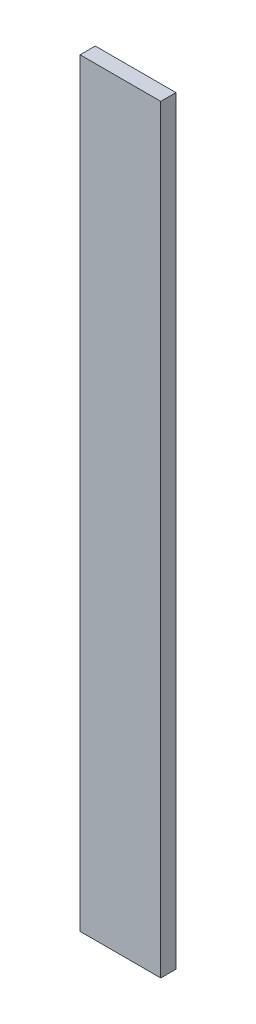
ISO-10303-21;
HEADER;
FILE_DESCRIPTION(('STEP AP214'),'2;1');
FILE_NAME('part.step','',(''),(''),'','','');
FILE_SCHEMA(('AUTOMOTIVE_DESIGN { 1 0 10303 214 1 1 1 1 }'));
ENDSEC;
DATA;
#1=APPLICATION_CONTEXT('core data for automotive mechanical design processes');
#2=APPLICATION_PROTOCOL_DEFINITION('international standard','automotive_design',2000,#1);
#3=PRODUCT_CONTEXT('',#1,'mechanical');
#4=PRODUCT('Part','Part','',(#3));
#5=PRODUCT_RELATED_PRODUCT_CATEGORY('part','',(#4));
#6=PRODUCT_DEFINITION_FORMATION('','',#4);
#7=PRODUCT_DEFINITION_CONTEXT('part definition',#1,'design');
#8=PRODUCT_DEFINITION('design','',#6,#7);
#9=PRODUCT_DEFINITION_SHAPE('','',#8);
#10=(LENGTH_UNIT() NAMED_UNIT(*) SI_UNIT(.MILLI.,.METRE.));
#11=(NAMED_UNIT(*) PLANE_ANGLE_UNIT() SI_UNIT($,.RADIAN.));
#12=(NAMED_UNIT(*) SI_UNIT($,.STERADIAN.) SOLID_ANGLE_UNIT());
#13=UNCERTAINTY_MEASURE_WITH_UNIT(LENGTH_MEASURE(1.E-05),#10,'distance_accuracy_value','');
#14=(GEOMETRIC_REPRESENTATION_CONTEXT(3) GLOBAL_UNCERTAINTY_ASSIGNED_CONTEXT((#13)) GLOBAL_UNIT_ASSIGNED_CONTEXT((#10,
#11,#12)) REPRESENTATION_CONTEXT('',''));
#15=CARTESIAN_POINT('',(0.,0.,0.));
#16=DIRECTION('',(0.,0.,1.));
#17=DIRECTION('',(1.,0.,0.));
#18=AXIS2_PLACEMENT_3D('',#15,#16,#17);
#19=CARTESIAN_POINT('',(165.444122233613,142.200586634191,5.9));
#20=DIRECTION('',(0.,0.,1.));
#21=DIRECTION('',(1.,0.,0.));
#22=AXIS2_PLACEMENT_3D('',#19,#20,#21);
#23=PLANE('',#22);
#24=DIRECTION('',(1.,0.,0.));
#25=VECTOR('',#24,1.);
#26=CARTESIAN_POINT('',(165.444122233613,147.200586634191,5.9));
#27=LINE('',#26,#25);
#28=CARTESIAN_POINT('',(165.975372233613,147.200586634191,5.9));
#29=VERTEX_POINT('',#28);
#30=CARTESIAN_POINT('',(165.444122233613,147.200586634191,5.9));
#31=VERTEX_POINT('',#30);
#32=EDGE_CURVE('E20',#29,#31,#27,.F.);
#33=ORIENTED_EDGE('',*,*,#32,.F.);
#34=DIRECTION('',(0.,1.,0.));
#35=VECTOR('',#34,1.);
#36=CARTESIAN_POINT('',(165.975372233613,142.200586634191,5.9));
#37=LINE('',#36,#35);
#38=CARTESIAN_POINT('',(165.975372233613,142.200586634191,5.9));
#39=VERTEX_POINT('',#38);
#40=EDGE_CURVE('E69',#29,#39,#37,.F.);
#41=ORIENTED_EDGE('',*,*,#40,.T.);
#42=DIRECTION('',(1.,0.,0.));
#43=VECTOR('',#42,1.);
#44=CARTESIAN_POINT('',(165.444122233613,142.200586634191,5.9));
#45=LINE('',#44,#43);
#46=CARTESIAN_POINT('',(165.444122233613,142.200586634191,5.9));
#47=VERTEX_POINT('',#46);
#48=EDGE_CURVE('E56',#39,#47,#45,.F.);
#49=ORIENTED_EDGE('',*,*,#48,.T.);
#50=DIRECTION('',(0.,1.,0.));
#51=VECTOR('',#50,1.);
#52=CARTESIAN_POINT('',(165.444122233613,147.200586634191,5.9));
#53=LINE('',#52,#51);
#54=EDGE_CURVE('E62',#47,#31,#53,.T.);
#55=ORIENTED_EDGE('',*,*,#54,.T.);
#56=EDGE_LOOP('',(#33,#41,#49,#55));
#57=FACE_BOUND('',#56,.T.);
#58=ADVANCED_FACE('F17',(#57),#23,.F.);
#59=CARTESIAN_POINT('',(165.444122233613,147.200586634191,6.));
#60=DIRECTION('',(1.,0.,0.));
#61=DIRECTION('',(0.,0.,-1.));
#62=AXIS2_PLACEMENT_3D('',#59,#60,#61);
#63=PLANE('',#62);
#64=DIRECTION('',(0.,0.,1.));
#65=VECTOR('',#64,1.);
#66=CARTESIAN_POINT('',(165.444122233613,142.200586634191,6.));
#67=LINE('',#66,#65);
#68=CARTESIAN_POINT('',(165.444122233613,142.200586634191,6.));
#69=VERTEX_POINT('',#68);
#70=EDGE_CURVE('E64',#47,#69,#67,.T.);
#71=ORIENTED_EDGE('',*,*,#70,.T.);
#72=DIRECTION('',(0.,1.,0.));
#73=VECTOR('',#72,1.);
#74=CARTESIAN_POINT('',(165.444122233613,142.200586634191,6.));
#75=LINE('',#74,#73);
#76=CARTESIAN_POINT('',(165.444122233613,147.200586634191,6.));
#77=VERTEX_POINT('',#76);
#78=EDGE_CURVE('E83',#77,#69,#75,.F.);
#79=ORIENTED_EDGE('',*,*,#78,.F.);
#80=DIRECTION('',(0.,0.,-1.));
#81=VECTOR('',#80,1.);
#82=CARTESIAN_POINT('',(165.444122233613,147.200586634191,6.));
#83=LINE('',#82,#81);
#84=EDGE_CURVE('E67',#77,#31,#83,.T.);
#85=ORIENTED_EDGE('',*,*,#84,.T.);
#86=ORIENTED_EDGE('',*,*,#54,.F.);
#87=EDGE_LOOP('',(#71,#79,#85,#86));
#88=FACE_BOUND('',#87,.T.);
#89=ADVANCED_FACE('F63',(#88),#63,.F.);
#90=CARTESIAN_POINT('',(165.444122233613,142.200586634191,6.));
#91=DIRECTION('',(0.,1.,0.));
#92=DIRECTION('',(0.,0.,1.));
#93=AXIS2_PLACEMENT_3D('',#90,#91,#92);
#94=PLANE('',#93);
#95=DIRECTION('',(0.,0.,1.));
#96=VECTOR('',#95,1.);
#97=CARTESIAN_POINT('',(165.975372233613,142.200586634191,6.));
#98=LINE('',#97,#96);
#99=CARTESIAN_POINT('',(165.975372233613,142.200586634191,6.));
#100=VERTEX_POINT('',#99);
#101=EDGE_CURVE('E71',#39,#100,#98,.T.);
#102=ORIENTED_EDGE('',*,*,#101,.T.);
#103=DIRECTION('',(1.,0.,0.));
#104=VECTOR('',#103,1.);
#105=CARTESIAN_POINT('',(165.444122233613,142.200586634191,6.));
#106=LINE('',#105,#104);
#107=EDGE_CURVE('E75',#69,#100,#106,.T.);
#108=ORIENTED_EDGE('',*,*,#107,.F.);
#109=ORIENTED_EDGE('',*,*,#70,.F.);
#110=ORIENTED_EDGE('',*,*,#48,.F.);
#111=EDGE_LOOP('',(#102,#108,#109,#110));
#112=FACE_BOUND('',#111,.T.);
#113=ADVANCED_FACE('F73',(#112),#94,.F.);
#114=CARTESIAN_POINT('',(165.975372233613,142.200586634191,6.));
#115=DIRECTION('',(-1.,0.,0.));
#116=DIRECTION('',(0.,0.,1.));
#117=AXIS2_PLACEMENT_3D('',#114,#115,#116);
#118=PLANE('',#117);
#119=DIRECTION('',(0.,0.,-1.));
#120=VECTOR('',#119,1.);
#121=CARTESIAN_POINT('',(165.975372233613,147.200586634191,6.));
#122=LINE('',#121,#120);
#123=CARTESIAN_POINT('',(165.975372233613,147.200586634191,6.));
#124=VERTEX_POINT('',#123);
#125=EDGE_CURVE('E35',#29,#124,#122,.F.);
#126=ORIENTED_EDGE('',*,*,#125,.T.);
#127=DIRECTION('',(0.,1.,0.));
#128=VECTOR('',#127,1.);
#129=CARTESIAN_POINT('',(165.975372233613,142.200586634191,6.));
#130=LINE('',#129,#128);
#131=EDGE_CURVE('E26',#100,#124,#130,.T.);
#132=ORIENTED_EDGE('',*,*,#131,.F.);
#133=ORIENTED_EDGE('',*,*,#101,.F.);
#134=ORIENTED_EDGE('',*,*,#40,.F.);
#135=EDGE_LOOP('',(#126,#132,#133,#134));
#136=FACE_BOUND('',#135,.T.);
#137=ADVANCED_FACE('F89',(#136),#118,.F.);
#138=CARTESIAN_POINT('',(165.975372233613,147.200586634191,6.));
#139=DIRECTION('',(0.,-1.,0.));
#140=DIRECTION('',(0.,0.,-1.));
#141=AXIS2_PLACEMENT_3D('',#138,#139,#140);
#142=PLANE('',#141);
#143=ORIENTED_EDGE('',*,*,#84,.F.);
#144=DIRECTION('',(1.,0.,0.));
#145=VECTOR('',#144,1.);
#146=CARTESIAN_POINT('',(165.444122233613,147.200586634191,6.));
#147=LINE('',#146,#145);
#148=EDGE_CURVE('E11',#124,#77,#147,.F.);
#149=ORIENTED_EDGE('',*,*,#148,.F.);
#150=ORIENTED_EDGE('',*,*,#125,.F.);
#151=ORIENTED_EDGE('',*,*,#32,.T.);
#152=EDGE_LOOP('',(#143,#149,#150,#151));
#153=FACE_BOUND('',#152,.T.);
#154=ADVANCED_FACE('F91',(#153),#142,.F.);
#155=CARTESIAN_POINT('',(165.444122233613,142.200586634191,6.));
#156=DIRECTION('',(0.,0.,1.));
#157=DIRECTION('',(1.,0.,0.));
#158=AXIS2_PLACEMENT_3D('',#155,#156,#157);
#159=PLANE('',#158);
#160=ORIENTED_EDGE('',*,*,#131,.T.);
#161=ORIENTED_EDGE('',*,*,#148,.T.);
#162=ORIENTED_EDGE('',*,*,#78,.T.);
#163=ORIENTED_EDGE('',*,*,#107,.T.);
#164=EDGE_LOOP('',(#160,#161,#162,#163));
#165=FACE_BOUND('',#164,.T.);
#166=ADVANCED_FACE('F88',(#165),#159,.T.);
#167=CLOSED_SHELL('',(#58,#89,#113,#137,#154,#166));
#168=MANIFOLD_SOLID_BREP('B1',#167);
#169=ADVANCED_BREP_SHAPE_REPRESENTATION('',(#18,#168),#14);
#170=SHAPE_DEFINITION_REPRESENTATION(#9,#169);
ENDSEC;
END-ISO-10303-21;
